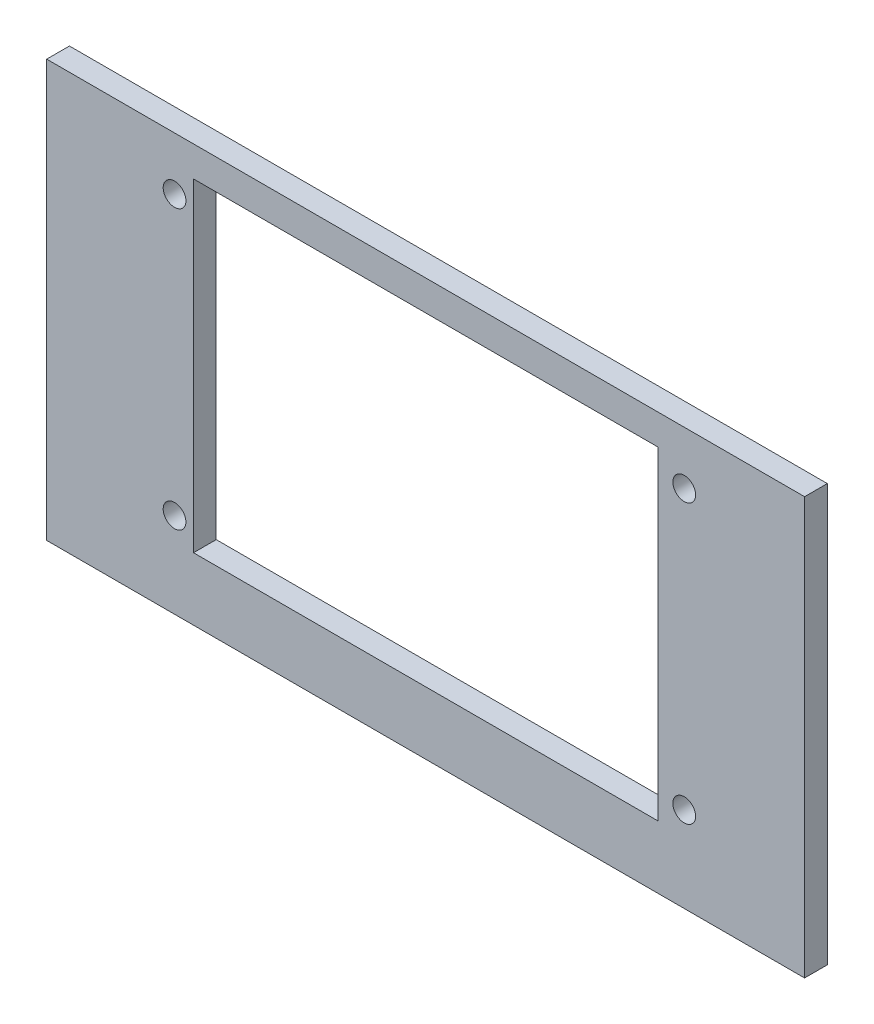
ISO-10303-21;
HEADER;
FILE_DESCRIPTION(('STEP AP214'),'2;1');
FILE_NAME('part.step','',(''),(''),'','','');
FILE_SCHEMA(('AUTOMOTIVE_DESIGN { 1 0 10303 214 1 1 1 1 }'));
ENDSEC;
DATA;
#1=APPLICATION_CONTEXT('core data for automotive mechanical design processes');
#2=APPLICATION_PROTOCOL_DEFINITION('international standard','automotive_design',2000,#1);
#3=PRODUCT_CONTEXT('',#1,'mechanical');
#4=PRODUCT('Part','Part','',(#3));
#5=PRODUCT_RELATED_PRODUCT_CATEGORY('part','',(#4));
#6=PRODUCT_DEFINITION_FORMATION('','',#4);
#7=PRODUCT_DEFINITION_CONTEXT('part definition',#1,'design');
#8=PRODUCT_DEFINITION('design','',#6,#7);
#9=PRODUCT_DEFINITION_SHAPE('','',#8);
#10=(LENGTH_UNIT() NAMED_UNIT(*) SI_UNIT(.MILLI.,.METRE.));
#11=(NAMED_UNIT(*) PLANE_ANGLE_UNIT() SI_UNIT($,.RADIAN.));
#12=(NAMED_UNIT(*) SI_UNIT($,.STERADIAN.) SOLID_ANGLE_UNIT());
#13=UNCERTAINTY_MEASURE_WITH_UNIT(LENGTH_MEASURE(1.E-05),#10,'distance_accuracy_value','');
#14=(GEOMETRIC_REPRESENTATION_CONTEXT(3) GLOBAL_UNCERTAINTY_ASSIGNED_CONTEXT((#13)) GLOBAL_UNIT_ASSIGNED_CONTEXT((#10,
#11,#12)) REPRESENTATION_CONTEXT('',''));
#15=CARTESIAN_POINT('',(0.,0.,0.));
#16=DIRECTION('',(0.,0.,1.));
#17=DIRECTION('',(1.,0.,0.));
#18=AXIS2_PLACEMENT_3D('',#15,#16,#17);
#19=CARTESIAN_POINT('',(0.,0.,3.));
#20=DIRECTION('',(0.,0.,-1.));
#21=DIRECTION('',(-1.,0.,0.));
#22=AXIS2_PLACEMENT_3D('',#19,#20,#21);
#23=PLANE('',#22);
#24=DIRECTION('',(0.,-1.,0.));
#25=VECTOR('',#24,1.);
#26=CARTESIAN_POINT('',(0.,0.,3.));
#27=LINE('',#26,#25);
#28=CARTESIAN_POINT('',(0.,55.,3.));
#29=VERTEX_POINT('',#28);
#30=CARTESIAN_POINT('',(0.,0.,3.));
#31=VERTEX_POINT('',#30);
#32=EDGE_CURVE('E137',#29,#31,#27,.T.);
#33=ORIENTED_EDGE('',*,*,#32,.T.);
#34=DIRECTION('',(1.,0.,0.));
#35=VECTOR('',#34,1.);
#36=CARTESIAN_POINT('',(0.,0.,3.));
#37=LINE('',#36,#35);
#38=CARTESIAN_POINT('',(100.,0.,3.));
#39=VERTEX_POINT('',#38);
#40=EDGE_CURVE('E140',#31,#39,#37,.T.);
#41=ORIENTED_EDGE('',*,*,#40,.T.);
#42=DIRECTION('',(0.,1.,0.));
#43=VECTOR('',#42,1.);
#44=CARTESIAN_POINT('',(100.,0.,3.));
#45=LINE('',#44,#43);
#46=CARTESIAN_POINT('',(100.,55.,3.));
#47=VERTEX_POINT('',#46);
#48=EDGE_CURVE('E143',#39,#47,#45,.T.);
#49=ORIENTED_EDGE('',*,*,#48,.T.);
#50=DIRECTION('',(-1.,0.,0.));
#51=VECTOR('',#50,1.);
#52=CARTESIAN_POINT('',(0.,55.,3.));
#53=LINE('',#52,#51);
#54=EDGE_CURVE('E145',#47,#29,#53,.T.);
#55=ORIENTED_EDGE('',*,*,#54,.T.);
#56=EDGE_LOOP('',(#33,#41,#49,#55));
#57=FACE_BOUND('',#56,.T.);
#58=DIRECTION('',(0.,-1.,0.));
#59=VECTOR('',#58,1.);
#60=CARTESIAN_POINT('',(19.37,8.28,3.));
#61=LINE('',#60,#59);
#62=CARTESIAN_POINT('',(19.37,51.,3.));
#63=VERTEX_POINT('',#62);
#64=CARTESIAN_POINT('',(19.37,8.28,3.));
#65=VERTEX_POINT('',#64);
#66=EDGE_CURVE('E98',#63,#65,#61,.T.);
#67=ORIENTED_EDGE('',*,*,#66,.F.);
#68=DIRECTION('',(-1.,0.,0.));
#69=VECTOR('',#68,1.);
#70=CARTESIAN_POINT('',(19.37,51.,3.));
#71=LINE('',#70,#69);
#72=CARTESIAN_POINT('',(80.63,51.,3.));
#73=VERTEX_POINT('',#72);
#74=EDGE_CURVE('E121',#73,#63,#71,.T.);
#75=ORIENTED_EDGE('',*,*,#74,.F.);
#76=DIRECTION('',(0.,1.,0.));
#77=VECTOR('',#76,1.);
#78=CARTESIAN_POINT('',(80.63,8.28,3.));
#79=LINE('',#78,#77);
#80=CARTESIAN_POINT('',(80.63,8.28,3.));
#81=VERTEX_POINT('',#80);
#82=EDGE_CURVE('E119',#81,#73,#79,.T.);
#83=ORIENTED_EDGE('',*,*,#82,.F.);
#84=DIRECTION('',(1.,0.,0.));
#85=VECTOR('',#84,1.);
#86=CARTESIAN_POINT('',(19.37,8.28,3.));
#87=LINE('',#86,#85);
#88=EDGE_CURVE('E106',#65,#81,#87,.T.);
#89=ORIENTED_EDGE('',*,*,#88,.F.);
#90=EDGE_LOOP('',(#67,#75,#83,#89));
#91=FACE_BOUND('',#90,.T.);
#92=CARTESIAN_POINT('',(84.12,48.,3.));
#93=DIRECTION('',(0.,0.,1.));
#94=DIRECTION('',(1.,0.,0.));
#95=AXIS2_PLACEMENT_3D('',#92,#93,#94);
#96=CIRCLE('',#95,1.5);
#97=CARTESIAN_POINT('',(85.62,48.,3.));
#98=VERTEX_POINT('',#97);
#99=EDGE_CURVE('E127',#98,#98,#96,.T.);
#100=ORIENTED_EDGE('',*,*,#99,.F.);
#101=EDGE_LOOP('',(#100));
#102=FACE_BOUND('',#101,.T.);
#103=CARTESIAN_POINT('',(16.87,48.,3.));
#104=DIRECTION('',(0.,0.,1.));
#105=DIRECTION('',(1.,0.,0.));
#106=AXIS2_PLACEMENT_3D('',#103,#104,#105);
#107=CIRCLE('',#106,1.5);
#108=CARTESIAN_POINT('',(18.37,48.,3.));
#109=VERTEX_POINT('',#108);
#110=EDGE_CURVE('E249',#109,#109,#107,.T.);
#111=ORIENTED_EDGE('',*,*,#110,.F.);
#112=EDGE_LOOP('',(#111));
#113=FACE_BOUND('',#112,.T.);
#114=CARTESIAN_POINT('',(16.87,11.28,3.));
#115=DIRECTION('',(0.,0.,1.));
#116=DIRECTION('',(1.,0.,0.));
#117=AXIS2_PLACEMENT_3D('',#114,#115,#116);
#118=CIRCLE('',#117,1.5);
#119=CARTESIAN_POINT('',(18.37,11.28,3.));
#120=VERTEX_POINT('',#119);
#121=EDGE_CURVE('E243',#120,#120,#118,.T.);
#122=ORIENTED_EDGE('',*,*,#121,.F.);
#123=EDGE_LOOP('',(#122));
#124=FACE_BOUND('',#123,.T.);
#125=CARTESIAN_POINT('',(84.12,11.28,3.));
#126=DIRECTION('',(0.,0.,1.));
#127=DIRECTION('',(1.,0.,0.));
#128=AXIS2_PLACEMENT_3D('',#125,#126,#127);
#129=CIRCLE('',#128,1.5);
#130=CARTESIAN_POINT('',(85.62,11.28,3.));
#131=VERTEX_POINT('',#130);
#132=EDGE_CURVE('E234',#131,#131,#129,.T.);
#133=ORIENTED_EDGE('',*,*,#132,.F.);
#134=EDGE_LOOP('',(#133));
#135=FACE_BOUND('',#134,.T.);
#136=ADVANCED_FACE('F33',(#57,#91,#102,#113,#124,#135),#23,.F.);
#137=CARTESIAN_POINT('',(0.,0.,0.));
#138=DIRECTION('',(0.,0.,-1.));
#139=DIRECTION('',(-1.,0.,0.));
#140=AXIS2_PLACEMENT_3D('',#137,#138,#139);
#141=PLANE('',#140);
#142=CARTESIAN_POINT('',(16.87,11.28,0.));
#143=DIRECTION('',(0.,0.,1.));
#144=DIRECTION('',(1.,0.,0.));
#145=AXIS2_PLACEMENT_3D('',#142,#143,#144);
#146=CIRCLE('',#145,1.5);
#147=CARTESIAN_POINT('',(18.37,11.28,0.));
#148=VERTEX_POINT('',#147);
#149=EDGE_CURVE('E240',#148,#148,#146,.T.);
#150=ORIENTED_EDGE('',*,*,#149,.T.);
#151=EDGE_LOOP('',(#150));
#152=FACE_BOUND('',#151,.T.);
#153=CARTESIAN_POINT('',(84.12,48.,0.));
#154=DIRECTION('',(0.,0.,1.));
#155=DIRECTION('',(1.,0.,0.));
#156=AXIS2_PLACEMENT_3D('',#153,#154,#155);
#157=CIRCLE('',#156,1.5);
#158=CARTESIAN_POINT('',(85.62,48.,0.));
#159=VERTEX_POINT('',#158);
#160=EDGE_CURVE('E252',#159,#159,#157,.T.);
#161=ORIENTED_EDGE('',*,*,#160,.T.);
#162=EDGE_LOOP('',(#161));
#163=FACE_BOUND('',#162,.T.);
#164=DIRECTION('',(0.,-1.,0.));
#165=VECTOR('',#164,1.);
#166=CARTESIAN_POINT('',(0.,0.,0.));
#167=LINE('',#166,#165);
#168=CARTESIAN_POINT('',(0.,55.,0.));
#169=VERTEX_POINT('',#168);
#170=CARTESIAN_POINT('',(0.,0.,0.));
#171=VERTEX_POINT('',#170);
#172=EDGE_CURVE('E114',#169,#171,#167,.T.);
#173=ORIENTED_EDGE('',*,*,#172,.F.);
#174=DIRECTION('',(-1.,0.,0.));
#175=VECTOR('',#174,1.);
#176=CARTESIAN_POINT('',(0.,55.,0.));
#177=LINE('',#176,#175);
#178=CARTESIAN_POINT('',(100.,55.,0.));
#179=VERTEX_POINT('',#178);
#180=EDGE_CURVE('E141',#179,#169,#177,.T.);
#181=ORIENTED_EDGE('',*,*,#180,.F.);
#182=DIRECTION('',(0.,1.,0.));
#183=VECTOR('',#182,1.);
#184=CARTESIAN_POINT('',(100.,0.,0.));
#185=LINE('',#184,#183);
#186=CARTESIAN_POINT('',(100.,0.,0.));
#187=VERTEX_POINT('',#186);
#188=EDGE_CURVE('E152',#187,#179,#185,.T.);
#189=ORIENTED_EDGE('',*,*,#188,.F.);
#190=DIRECTION('',(1.,0.,0.));
#191=VECTOR('',#190,1.);
#192=CARTESIAN_POINT('',(0.,0.,0.));
#193=LINE('',#192,#191);
#194=EDGE_CURVE('E150',#171,#187,#193,.T.);
#195=ORIENTED_EDGE('',*,*,#194,.F.);
#196=EDGE_LOOP('',(#173,#181,#189,#195));
#197=FACE_BOUND('',#196,.T.);
#198=DIRECTION('',(-1.,0.,0.));
#199=VECTOR('',#198,1.);
#200=CARTESIAN_POINT('',(19.37,51.,0.));
#201=LINE('',#200,#199);
#202=CARTESIAN_POINT('',(80.63,51.,0.));
#203=VERTEX_POINT('',#202);
#204=CARTESIAN_POINT('',(19.37,51.,0.));
#205=VERTEX_POINT('',#204);
#206=EDGE_CURVE('E107',#203,#205,#201,.T.);
#207=ORIENTED_EDGE('',*,*,#206,.T.);
#208=DIRECTION('',(0.,-1.,0.));
#209=VECTOR('',#208,1.);
#210=CARTESIAN_POINT('',(19.37,8.28,0.));
#211=LINE('',#210,#209);
#212=CARTESIAN_POINT('',(19.37,8.28,0.));
#213=VERTEX_POINT('',#212);
#214=EDGE_CURVE('E56',#205,#213,#211,.T.);
#215=ORIENTED_EDGE('',*,*,#214,.T.);
#216=DIRECTION('',(1.,0.,0.));
#217=VECTOR('',#216,1.);
#218=CARTESIAN_POINT('',(19.37,8.28,0.));
#219=LINE('',#218,#217);
#220=CARTESIAN_POINT('',(80.63,8.28,0.));
#221=VERTEX_POINT('',#220);
#222=EDGE_CURVE('E113',#213,#221,#219,.T.);
#223=ORIENTED_EDGE('',*,*,#222,.T.);
#224=DIRECTION('',(0.,1.,0.));
#225=VECTOR('',#224,1.);
#226=CARTESIAN_POINT('',(80.63,8.28,0.));
#227=LINE('',#226,#225);
#228=EDGE_CURVE('E129',#221,#203,#227,.T.);
#229=ORIENTED_EDGE('',*,*,#228,.T.);
#230=EDGE_LOOP('',(#207,#215,#223,#229));
#231=FACE_BOUND('',#230,.T.);
#232=CARTESIAN_POINT('',(16.87,48.,0.));
#233=DIRECTION('',(0.,0.,1.));
#234=DIRECTION('',(1.,0.,0.));
#235=AXIS2_PLACEMENT_3D('',#232,#233,#234);
#236=CIRCLE('',#235,1.5);
#237=CARTESIAN_POINT('',(18.37,48.,0.));
#238=VERTEX_POINT('',#237);
#239=EDGE_CURVE('E246',#238,#238,#236,.T.);
#240=ORIENTED_EDGE('',*,*,#239,.T.);
#241=EDGE_LOOP('',(#240));
#242=FACE_BOUND('',#241,.T.);
#243=CARTESIAN_POINT('',(84.12,11.28,0.));
#244=DIRECTION('',(0.,0.,1.));
#245=DIRECTION('',(1.,0.,0.));
#246=AXIS2_PLACEMENT_3D('',#243,#244,#245);
#247=CIRCLE('',#246,1.5);
#248=CARTESIAN_POINT('',(85.62,11.28,0.));
#249=VERTEX_POINT('',#248);
#250=EDGE_CURVE('E237',#249,#249,#247,.T.);
#251=ORIENTED_EDGE('',*,*,#250,.T.);
#252=EDGE_LOOP('',(#251));
#253=FACE_BOUND('',#252,.T.);
#254=ADVANCED_FACE('F170',(#152,#163,#197,#231,#242,#253),#141,.T.);
#255=CARTESIAN_POINT('',(0.,0.,3.));
#256=DIRECTION('',(1.,0.,0.));
#257=DIRECTION('',(0.,0.,-1.));
#258=AXIS2_PLACEMENT_3D('',#255,#256,#257);
#259=PLANE('',#258);
#260=ORIENTED_EDGE('',*,*,#172,.T.);
#261=DIRECTION('',(0.,0.,-1.));
#262=VECTOR('',#261,1.);
#263=CARTESIAN_POINT('',(0.,0.,3.));
#264=LINE('',#263,#262);
#265=EDGE_CURVE('E11',#31,#171,#264,.T.);
#266=ORIENTED_EDGE('',*,*,#265,.F.);
#267=ORIENTED_EDGE('',*,*,#32,.F.);
#268=DIRECTION('',(0.,0.,-1.));
#269=VECTOR('',#268,1.);
#270=CARTESIAN_POINT('',(0.,55.,3.));
#271=LINE('',#270,#269);
#272=EDGE_CURVE('E147',#29,#169,#271,.T.);
#273=ORIENTED_EDGE('',*,*,#272,.T.);
#274=EDGE_LOOP('',(#260,#266,#267,#273));
#275=FACE_BOUND('',#274,.T.);
#276=ADVANCED_FACE('F35',(#275),#259,.F.);
#277=CARTESIAN_POINT('',(0.,0.,3.));
#278=DIRECTION('',(0.,1.,0.));
#279=DIRECTION('',(0.,0.,1.));
#280=AXIS2_PLACEMENT_3D('',#277,#278,#279);
#281=PLANE('',#280);
#282=ORIENTED_EDGE('',*,*,#194,.T.);
#283=DIRECTION('',(0.,0.,-1.));
#284=VECTOR('',#283,1.);
#285=CARTESIAN_POINT('',(100.,0.,3.));
#286=LINE('',#285,#284);
#287=EDGE_CURVE('E41',#39,#187,#286,.T.);
#288=ORIENTED_EDGE('',*,*,#287,.F.);
#289=ORIENTED_EDGE('',*,*,#40,.F.);
#290=ORIENTED_EDGE('',*,*,#265,.T.);
#291=EDGE_LOOP('',(#282,#288,#289,#290));
#292=FACE_BOUND('',#291,.T.);
#293=ADVANCED_FACE('F180',(#292),#281,.F.);
#294=CARTESIAN_POINT('',(100.,0.,3.));
#295=DIRECTION('',(-1.,0.,0.));
#296=DIRECTION('',(0.,0.,1.));
#297=AXIS2_PLACEMENT_3D('',#294,#295,#296);
#298=PLANE('',#297);
#299=ORIENTED_EDGE('',*,*,#188,.T.);
#300=DIRECTION('',(0.,0.,-1.));
#301=VECTOR('',#300,1.);
#302=CARTESIAN_POINT('',(100.,55.,3.));
#303=LINE('',#302,#301);
#304=EDGE_CURVE('E157',#47,#179,#303,.T.);
#305=ORIENTED_EDGE('',*,*,#304,.F.);
#306=ORIENTED_EDGE('',*,*,#48,.F.);
#307=ORIENTED_EDGE('',*,*,#287,.T.);
#308=EDGE_LOOP('',(#299,#305,#306,#307));
#309=FACE_BOUND('',#308,.T.);
#310=ADVANCED_FACE('F164',(#309),#298,.F.);
#311=CARTESIAN_POINT('',(0.,55.,3.));
#312=DIRECTION('',(0.,-1.,0.));
#313=DIRECTION('',(0.,0.,-1.));
#314=AXIS2_PLACEMENT_3D('',#311,#312,#313);
#315=PLANE('',#314);
#316=ORIENTED_EDGE('',*,*,#180,.T.);
#317=ORIENTED_EDGE('',*,*,#272,.F.);
#318=ORIENTED_EDGE('',*,*,#54,.F.);
#319=ORIENTED_EDGE('',*,*,#304,.T.);
#320=EDGE_LOOP('',(#316,#317,#318,#319));
#321=FACE_BOUND('',#320,.T.);
#322=ADVANCED_FACE('F174',(#321),#315,.F.);
#323=CARTESIAN_POINT('',(19.37,8.28,3.));
#324=DIRECTION('',(1.,0.,0.));
#325=DIRECTION('',(0.,0.,-1.));
#326=AXIS2_PLACEMENT_3D('',#323,#324,#325);
#327=PLANE('',#326);
#328=ORIENTED_EDGE('',*,*,#214,.F.);
#329=DIRECTION('',(0.,0.,-1.));
#330=VECTOR('',#329,1.);
#331=CARTESIAN_POINT('',(19.37,51.,3.));
#332=LINE('',#331,#330);
#333=EDGE_CURVE('E102',#63,#205,#332,.T.);
#334=ORIENTED_EDGE('',*,*,#333,.F.);
#335=ORIENTED_EDGE('',*,*,#66,.T.);
#336=DIRECTION('',(0.,0.,-1.));
#337=VECTOR('',#336,1.);
#338=CARTESIAN_POINT('',(19.37,8.28,3.));
#339=LINE('',#338,#337);
#340=EDGE_CURVE('E101',#65,#213,#339,.T.);
#341=ORIENTED_EDGE('',*,*,#340,.T.);
#342=EDGE_LOOP('',(#328,#334,#335,#341));
#343=FACE_BOUND('',#342,.T.);
#344=ADVANCED_FACE('F100',(#343),#327,.T.);
#345=CARTESIAN_POINT('',(19.37,8.28,3.));
#346=DIRECTION('',(0.,1.,0.));
#347=DIRECTION('',(0.,0.,1.));
#348=AXIS2_PLACEMENT_3D('',#345,#346,#347);
#349=PLANE('',#348);
#350=ORIENTED_EDGE('',*,*,#222,.F.);
#351=ORIENTED_EDGE('',*,*,#340,.F.);
#352=ORIENTED_EDGE('',*,*,#88,.T.);
#353=DIRECTION('',(0.,0.,-1.));
#354=VECTOR('',#353,1.);
#355=CARTESIAN_POINT('',(80.63,8.28,3.));
#356=LINE('',#355,#354);
#357=EDGE_CURVE('E115',#81,#221,#356,.T.);
#358=ORIENTED_EDGE('',*,*,#357,.T.);
#359=EDGE_LOOP('',(#350,#351,#352,#358));
#360=FACE_BOUND('',#359,.T.);
#361=ADVANCED_FACE('F110',(#360),#349,.T.);
#362=CARTESIAN_POINT('',(80.63,8.28,3.));
#363=DIRECTION('',(-1.,0.,0.));
#364=DIRECTION('',(0.,0.,1.));
#365=AXIS2_PLACEMENT_3D('',#362,#363,#364);
#366=PLANE('',#365);
#367=ORIENTED_EDGE('',*,*,#228,.F.);
#368=ORIENTED_EDGE('',*,*,#357,.F.);
#369=ORIENTED_EDGE('',*,*,#82,.T.);
#370=DIRECTION('',(0.,0.,-1.));
#371=VECTOR('',#370,1.);
#372=CARTESIAN_POINT('',(80.63,51.,3.));
#373=LINE('',#372,#371);
#374=EDGE_CURVE('E48',#73,#203,#373,.T.);
#375=ORIENTED_EDGE('',*,*,#374,.T.);
#376=EDGE_LOOP('',(#367,#368,#369,#375));
#377=FACE_BOUND('',#376,.T.);
#378=ADVANCED_FACE('F204',(#377),#366,.T.);
#379=CARTESIAN_POINT('',(19.37,51.,3.));
#380=DIRECTION('',(0.,-1.,0.));
#381=DIRECTION('',(0.,0.,-1.));
#382=AXIS2_PLACEMENT_3D('',#379,#380,#381);
#383=PLANE('',#382);
#384=ORIENTED_EDGE('',*,*,#206,.F.);
#385=ORIENTED_EDGE('',*,*,#374,.F.);
#386=ORIENTED_EDGE('',*,*,#74,.T.);
#387=ORIENTED_EDGE('',*,*,#333,.T.);
#388=EDGE_LOOP('',(#384,#385,#386,#387));
#389=FACE_BOUND('',#388,.T.);
#390=ADVANCED_FACE('F208',(#389),#383,.T.);
#391=CARTESIAN_POINT('',(84.12,48.,3.));
#392=DIRECTION('',(0.,0.,-1.));
#393=DIRECTION('',(-1.,0.,0.));
#394=AXIS2_PLACEMENT_3D('',#391,#392,#393);
#395=CYLINDRICAL_SURFACE('',#394,1.5);
#396=ORIENTED_EDGE('',*,*,#99,.T.);
#397=EDGE_LOOP('',(#396));
#398=FACE_BOUND('',#397,.T.);
#399=ORIENTED_EDGE('',*,*,#160,.F.);
#400=EDGE_LOOP('',(#399));
#401=FACE_BOUND('',#400,.T.);
#402=ADVANCED_FACE('F214',(#398,#401),#395,.F.);
#403=CARTESIAN_POINT('',(16.87,48.,3.));
#404=DIRECTION('',(0.,0.,-1.));
#405=DIRECTION('',(-1.,0.,0.));
#406=AXIS2_PLACEMENT_3D('',#403,#404,#405);
#407=CYLINDRICAL_SURFACE('',#406,1.5);
#408=ORIENTED_EDGE('',*,*,#110,.T.);
#409=EDGE_LOOP('',(#408));
#410=FACE_BOUND('',#409,.T.);
#411=ORIENTED_EDGE('',*,*,#239,.F.);
#412=EDGE_LOOP('',(#411));
#413=FACE_BOUND('',#412,.T.);
#414=ADVANCED_FACE('F217',(#410,#413),#407,.F.);
#415=CARTESIAN_POINT('',(16.87,11.28,3.));
#416=DIRECTION('',(0.,0.,-1.));
#417=DIRECTION('',(-1.,0.,0.));
#418=AXIS2_PLACEMENT_3D('',#415,#416,#417);
#419=CYLINDRICAL_SURFACE('',#418,1.5);
#420=ORIENTED_EDGE('',*,*,#121,.T.);
#421=EDGE_LOOP('',(#420));
#422=FACE_BOUND('',#421,.T.);
#423=ORIENTED_EDGE('',*,*,#149,.F.);
#424=EDGE_LOOP('',(#423));
#425=FACE_BOUND('',#424,.T.);
#426=ADVANCED_FACE('F221',(#422,#425),#419,.F.);
#427=CARTESIAN_POINT('',(84.12,11.28,3.));
#428=DIRECTION('',(0.,0.,-1.));
#429=DIRECTION('',(-1.,0.,0.));
#430=AXIS2_PLACEMENT_3D('',#427,#428,#429);
#431=CYLINDRICAL_SURFACE('',#430,1.5);
#432=ORIENTED_EDGE('',*,*,#132,.T.);
#433=EDGE_LOOP('',(#432));
#434=FACE_BOUND('',#433,.T.);
#435=ORIENTED_EDGE('',*,*,#250,.F.);
#436=EDGE_LOOP('',(#435));
#437=FACE_BOUND('',#436,.T.);
#438=ADVANCED_FACE('F225',(#434,#437),#431,.F.);
#439=CLOSED_SHELL('',(#136,#254,#276,#293,#310,#322,#344,#361,#378,#390,#402,#414,#426,#438));
#440=MANIFOLD_SOLID_BREP('B2',#439);
#441=ADVANCED_BREP_SHAPE_REPRESENTATION('',(#18,#440),#14);
#442=SHAPE_DEFINITION_REPRESENTATION(#9,#441);
ENDSEC;
END-ISO-10303-21;
